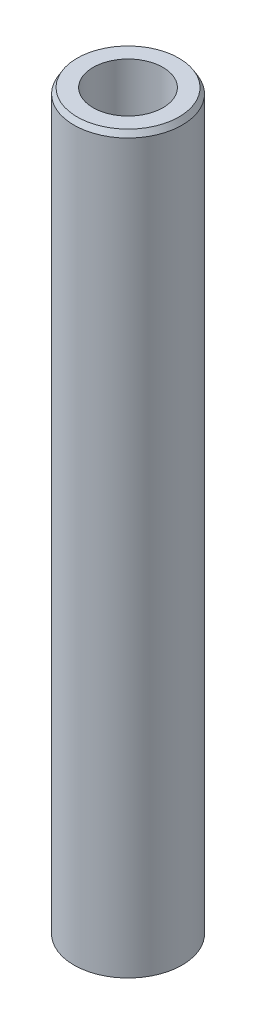
ISO-10303-21;
HEADER;
FILE_DESCRIPTION(('STEP AP214'),'2;1');
FILE_NAME('part.step','',(''),(''),'','','');
FILE_SCHEMA(('AUTOMOTIVE_DESIGN { 1 0 10303 214 1 1 1 1 }'));
ENDSEC;
DATA;
#1=APPLICATION_CONTEXT('core data for automotive mechanical design processes');
#2=APPLICATION_PROTOCOL_DEFINITION('international standard','automotive_design',2000,#1);
#3=PRODUCT_CONTEXT('',#1,'mechanical');
#4=PRODUCT('Part','Part','',(#3));
#5=PRODUCT_RELATED_PRODUCT_CATEGORY('part','',(#4));
#6=PRODUCT_DEFINITION_FORMATION('','',#4);
#7=PRODUCT_DEFINITION_CONTEXT('part definition',#1,'design');
#8=PRODUCT_DEFINITION('design','',#6,#7);
#9=PRODUCT_DEFINITION_SHAPE('','',#8);
#10=(LENGTH_UNIT() NAMED_UNIT(*) SI_UNIT(.MILLI.,.METRE.));
#11=(NAMED_UNIT(*) PLANE_ANGLE_UNIT() SI_UNIT($,.RADIAN.));
#12=(NAMED_UNIT(*) SI_UNIT($,.STERADIAN.) SOLID_ANGLE_UNIT());
#13=UNCERTAINTY_MEASURE_WITH_UNIT(LENGTH_MEASURE(1.E-05),#10,'distance_accuracy_value','');
#14=(GEOMETRIC_REPRESENTATION_CONTEXT(3) GLOBAL_UNCERTAINTY_ASSIGNED_CONTEXT((#13)) GLOBAL_UNIT_ASSIGNED_CONTEXT((#10,
#11,#12)) REPRESENTATION_CONTEXT('',''));
#15=CARTESIAN_POINT('',(0.,0.,0.));
#16=DIRECTION('',(0.,0.,1.));
#17=DIRECTION('',(1.,0.,0.));
#18=AXIS2_PLACEMENT_3D('',#15,#16,#17);
#19=CARTESIAN_POINT('',(0.,102.049210946961,0.));
#20=DIRECTION('',(0.,-1.,0.));
#21=DIRECTION('',(0.,0.,-1.));
#22=AXIS2_PLACEMENT_3D('',#19,#20,#21);
#23=CYLINDRICAL_SURFACE('',#22,7.5);
#24=CARTESIAN_POINT('',(0.,101.286577049852,0.));
#25=DIRECTION('',(0.,1.,0.));
#26=DIRECTION('',(0.,0.,1.));
#27=AXIS2_PLACEMENT_3D('',#24,#25,#26);
#28=CIRCLE('',#27,7.5);
#29=CARTESIAN_POINT('',(0.,101.286577049852,-7.5));
#30=VERTEX_POINT('',#29);
#31=EDGE_CURVE('E50',#30,#30,#28,.F.);
#32=ORIENTED_EDGE('',*,*,#31,.T.);
#33=EDGE_LOOP('',(#32));
#34=FACE_BOUND('',#33,.T.);
#35=CARTESIAN_POINT('',(0.,0.440306885789027,0.));
#36=DIRECTION('',(0.,1.,0.));
#37=DIRECTION('',(0.,0.,1.));
#38=AXIS2_PLACEMENT_3D('',#35,#36,#37);
#39=CIRCLE('',#38,7.5);
#40=CARTESIAN_POINT('',(0.,0.440306885789027,7.5));
#41=VERTEX_POINT('',#40);
#42=EDGE_CURVE('E51',#41,#41,#39,.T.);
#43=ORIENTED_EDGE('',*,*,#42,.T.);
#44=EDGE_LOOP('',(#43));
#45=FACE_BOUND('',#44,.T.);
#46=ADVANCED_FACE('F39',(#34,#45),#23,.T.);
#47=CARTESIAN_POINT('',(0.,102.049210946961,0.));
#48=DIRECTION('',(0.,1.,0.));
#49=DIRECTION('',(0.,0.,1.));
#50=AXIS2_PLACEMENT_3D('',#47,#48,#49);
#51=PLANE('',#50);
#52=CARTESIAN_POINT('',(0.,102.049210946961,0.));
#53=DIRECTION('',(0.,1.,0.));
#54=DIRECTION('',(0.,0.,1.));
#55=AXIS2_PLACEMENT_3D('',#52,#53,#54);
#56=CIRCLE('',#55,7.05969311421097);
#57=CARTESIAN_POINT('',(0.,102.049210946961,-7.05969311421097));
#58=VERTEX_POINT('',#57);
#59=EDGE_CURVE('E54',#58,#58,#56,.T.);
#60=ORIENTED_EDGE('',*,*,#59,.T.);
#61=EDGE_LOOP('',(#60));
#62=FACE_BOUND('',#61,.T.);
#63=CARTESIAN_POINT('',(0.,102.049210946961,0.));
#64=DIRECTION('',(0.,1.,0.));
#65=DIRECTION('',(0.,0.,1.));
#66=AXIS2_PLACEMENT_3D('',#63,#64,#65);
#67=CIRCLE('',#66,4.84571546352787);
#68=CARTESIAN_POINT('',(0.,102.049210946961,4.84571546352787));
#69=VERTEX_POINT('',#68);
#70=EDGE_CURVE('E58',#69,#69,#67,.T.);
#71=ORIENTED_EDGE('',*,*,#70,.F.);
#72=EDGE_LOOP('',(#71));
#73=FACE_BOUND('',#72,.T.);
#74=ADVANCED_FACE('F69',(#62,#73),#51,.T.);
#75=CARTESIAN_POINT('',(0.,0.,0.));
#76=DIRECTION('',(0.,1.,0.));
#77=DIRECTION('',(0.,0.,1.));
#78=AXIS2_PLACEMENT_3D('',#75,#76,#77);
#79=PLANE('',#78);
#80=CARTESIAN_POINT('',(0.,0.,0.));
#81=DIRECTION('',(0.,1.,0.));
#82=DIRECTION('',(0.,0.,1.));
#83=AXIS2_PLACEMENT_3D('',#80,#81,#82);
#84=CIRCLE('',#83,6.73736610289097);
#85=CARTESIAN_POINT('',(0.,0.,6.73736610289097));
#86=VERTEX_POINT('',#85);
#87=EDGE_CURVE('E10',#86,#86,#84,.F.);
#88=ORIENTED_EDGE('',*,*,#87,.T.);
#89=EDGE_LOOP('',(#88));
#90=FACE_BOUND('',#89,.T.);
#91=CARTESIAN_POINT('',(0.,0.,0.));
#92=DIRECTION('',(0.,1.,0.));
#93=DIRECTION('',(0.,0.,1.));
#94=AXIS2_PLACEMENT_3D('',#91,#92,#93);
#95=CIRCLE('',#94,4.84571546352787);
#96=CARTESIAN_POINT('',(0.,0.,4.84571546352787));
#97=VERTEX_POINT('',#96);
#98=EDGE_CURVE('E63',#97,#97,#95,.T.);
#99=ORIENTED_EDGE('',*,*,#98,.T.);
#100=EDGE_LOOP('',(#99));
#101=FACE_BOUND('',#100,.T.);
#102=ADVANCED_FACE('F75',(#90,#101),#79,.F.);
#103=CARTESIAN_POINT('',(0.,102.049210946961,0.));
#104=DIRECTION('',(0.,-1.,0.));
#105=DIRECTION('',(0.,0.,-1.));
#106=AXIS2_PLACEMENT_3D('',#103,#104,#105);
#107=CYLINDRICAL_SURFACE('',#106,4.84571546352787);
#108=ORIENTED_EDGE('',*,*,#70,.T.);
#109=EDGE_LOOP('',(#108));
#110=FACE_BOUND('',#109,.T.);
#111=ORIENTED_EDGE('',*,*,#98,.F.);
#112=EDGE_LOOP('',(#111));
#113=FACE_BOUND('',#112,.T.);
#114=ADVANCED_FACE('F70',(#110,#113),#107,.F.);
#115=CARTESIAN_POINT('',(0.,102.049210946961,0.));
#116=DIRECTION('',(0.,-1.,0.));
#117=DIRECTION('',(0.,0.,-1.));
#118=AXIS2_PLACEMENT_3D('',#115,#116,#117);
#119=CONICAL_SURFACE('',#118,7.05969311421097,0.523598775598296);
#120=CARTESIAN_POINT('',(0.,101.286577049852,-7.5));
#121=CARTESIAN_POINT('',(0.,101.294521152947,-7.4954134699397));
#122=CARTESIAN_POINT('',(0.,101.302465256042,-7.4908269398794));
#123=CARTESIAN_POINT('',(0.,101.318353462232,-7.4816538797588));
#124=CARTESIAN_POINT('',(0.,101.326297565327,-7.47706734969849));
#125=CARTESIAN_POINT('',(0.,101.342185771516,-7.46789428957789));
#126=CARTESIAN_POINT('',(0.,101.350129874611,-7.46330775951758));
#127=CARTESIAN_POINT('',(0.,101.366018080801,-7.45413469939698));
#128=CARTESIAN_POINT('',(0.,101.373962183896,-7.44954816933668));
#129=CARTESIAN_POINT('',(0.,101.389850390086,-7.44037510921607));
#130=CARTESIAN_POINT('',(0.,101.397794493181,-7.43578857915577));
#131=CARTESIAN_POINT('',(0.,101.41368269937,-7.42661551903516));
#132=CARTESIAN_POINT('',(0.,101.421626802465,-7.42202898897486));
#133=CARTESIAN_POINT('',(0.,101.437515008655,-7.41285592885426));
#134=CARTESIAN_POINT('',(0.,101.44545911175,-7.40826939879396));
#135=CARTESIAN_POINT('',(0.,101.46134731794,-7.39909633867335));
#136=CARTESIAN_POINT('',(0.,101.469291421035,-7.39450980861305));
#137=CARTESIAN_POINT('',(0.,101.485179627224,-7.38533674849244));
#138=CARTESIAN_POINT('',(0.,101.493123730319,-7.38075021843214));
#139=CARTESIAN_POINT('',(0.,101.509011936509,-7.37157715831154));
#140=CARTESIAN_POINT('',(0.,101.516956039604,-7.36699062825123));
#141=CARTESIAN_POINT('',(0.,101.532844245794,-7.35781756813063));
#142=CARTESIAN_POINT('',(0.,101.540788348889,-7.35323103807033));
#143=CARTESIAN_POINT('',(0.,101.556676555078,-7.34405797794972));
#144=CARTESIAN_POINT('',(0.,101.564620658173,-7.33947144788942));
#145=CARTESIAN_POINT('',(0.,101.580508864363,-7.33029838776881));
#146=CARTESIAN_POINT('',(0.,101.588452967458,-7.32571185770851));
#147=CARTESIAN_POINT('',(0.,101.604341173648,-7.31653879758791));
#148=CARTESIAN_POINT('',(0.,101.612285276742,-7.3119522675276));
#149=CARTESIAN_POINT('',(0.,101.628173482932,-7.302779207407));
#150=CARTESIAN_POINT('',(0.,101.636117586027,-7.2981926773467));
#151=CARTESIAN_POINT('',(0.,101.652005792217,-7.28901961722609));
#152=CARTESIAN_POINT('',(0.,101.659949895312,-7.28443308716579));
#153=CARTESIAN_POINT('',(0.,101.675838101502,-7.27526002704518));
#154=CARTESIAN_POINT('',(0.,101.683782204596,-7.27067349698488));
#155=CARTESIAN_POINT('',(0.,101.699670410786,-7.26150043686428));
#156=CARTESIAN_POINT('',(0.,101.707614513881,-7.25691390680397));
#157=CARTESIAN_POINT('',(0.,101.723502720071,-7.24774084668337));
#158=CARTESIAN_POINT('',(0.,101.731446823166,-7.24315431662307));
#159=CARTESIAN_POINT('',(0.,101.747335029356,-7.23398125650246));
#160=CARTESIAN_POINT('',(0.,101.75527913245,-7.22939472644216));
#161=CARTESIAN_POINT('',(0.,101.77116733864,-7.22022166632155));
#162=CARTESIAN_POINT('',(0.,101.779111441735,-7.21563513626125));
#163=CARTESIAN_POINT('',(0.,101.794999647925,-7.20646207614065));
#164=CARTESIAN_POINT('',(0.,101.80294375102,-7.20187554608035));
#165=CARTESIAN_POINT('',(0.,101.81883195721,-7.19270248595974));
#166=CARTESIAN_POINT('',(0.,101.826776060304,-7.18811595589944));
#167=CARTESIAN_POINT('',(0.,101.842664266494,-7.17894289577883));
#168=CARTESIAN_POINT('',(0.,101.850608369589,-7.17435636571853));
#169=CARTESIAN_POINT('',(0.,101.866496575779,-7.16518330559793));
#170=CARTESIAN_POINT('',(0.,101.874440678874,-7.16059677553762));
#171=CARTESIAN_POINT('',(0.,101.890328885064,-7.15142371541702));
#172=CARTESIAN_POINT('',(0.,101.898272988158,-7.14683718535671));
#173=CARTESIAN_POINT('',(0.,101.914161194348,-7.13766412523611));
#174=CARTESIAN_POINT('',(0.,101.922105297443,-7.13307759517581));
#175=CARTESIAN_POINT('',(0.,101.937993503633,-7.12390453505521));
#176=CARTESIAN_POINT('',(0.,101.945937606728,-7.1193180049949));
#177=CARTESIAN_POINT('',(0.,101.961825812917,-7.1101449448743));
#178=CARTESIAN_POINT('',(0.,101.969769916012,-7.10555841481399));
#179=CARTESIAN_POINT('',(0.,101.985658122202,-7.09638535469339));
#180=CARTESIAN_POINT('',(0.,101.993602225297,-7.09179882463309));
#181=CARTESIAN_POINT('',(0.,102.009490431487,-7.08262576451248));
#182=CARTESIAN_POINT('',(0.,102.017434534582,-7.07803923445218));
#183=CARTESIAN_POINT('',(0.,102.033322740771,-7.06886617433157));
#184=CARTESIAN_POINT('',(0.,102.041266843866,-7.06427964427127));
#185=CARTESIAN_POINT('',(0.,102.049210946961,-7.05969311421097));
#186=B_SPLINE_CURVE_WITH_KNOTS('',3,(#120,#121,#122,#123,#124,#125,#126,#127,#128,#129,#130,
#131,#132,#133,#134,#135,#136,#137,#138,#139,#140,#141,#142,#143,#144,#145,#146,#147,#148,#149,
#150,#151,#152,#153,#154,#155,#156,#157,#158,#159,#160,#161,#162,#163,#164,#165,#166,#167,#168,
#169,#170,#171,#172,#173,#174,#175,#176,#177,#178,#179,#180,#181,#182,#183,#184,#185),
.UNSPECIFIED.,.F.,.F.,(4,2,2,2,2,2,2,2,2,2,2,2,2,2,2,2,2,2,2,2,2,2,2,2,2,2,2,2,2,2,2,2,4),(0.,
0.0275191803618244,0.0550383607236372,0.0825575410854496,0.110076721447262,0.137595901809075,
0.165115082170899,0.192634262532712,0.220153442894524,0.247672623256336,0.275191803618149,
0.302710983979974,0.330230164341786,0.357749344703599,0.385268525065411,0.412787705427224,
0.440306885789036,0.467826066150861,0.495345246512673,0.522864426874486,0.550383607236298,
0.577902787598111,0.605421967959935,0.632941148321748,0.66046032868356,0.687979509045373,
0.715498689407185,0.743017869769009,0.770537050130822,0.798056230492635,0.825575410854447,
0.853094591216259,0.880613771578084),.UNSPECIFIED.);
#187=EDGE_CURVE('BSEAM81',#30,#58,#186,.T.);
#188=ORIENTED_EDGE('',*,*,#31,.F.);
#189=ORIENTED_EDGE('',*,*,#59,.F.);
#190=ORIENTED_EDGE('',*,*,#187,.T.);
#191=ORIENTED_EDGE('',*,*,#187,.F.);
#192=EDGE_LOOP('',(#188,#190,#189,#191));
#193=FACE_BOUND('',#192,.T.);
#194=ADVANCED_FACE('F81',(#193),#119,.T.);
#195=CARTESIAN_POINT('',(0.,0.440306885789027,0.));
#196=DIRECTION('',(0.,1.,0.));
#197=DIRECTION('',(0.,0.,1.));
#198=AXIS2_PLACEMENT_3D('',#195,#196,#197);
#199=CONICAL_SURFACE('',#198,7.5,1.0471975511966);
#200=ORIENTED_EDGE('',*,*,#87,.F.);
#201=EDGE_LOOP('',(#200));
#202=FACE_BOUND('',#201,.T.);
#203=ORIENTED_EDGE('',*,*,#42,.F.);
#204=EDGE_LOOP('',(#203));
#205=FACE_BOUND('',#204,.T.);
#206=ADVANCED_FACE('F45',(#202,#205),#199,.T.);
#207=CLOSED_SHELL('',(#46,#74,#102,#114,#194,#206));
#208=MANIFOLD_SOLID_BREP('B2',#207);
#209=ADVANCED_BREP_SHAPE_REPRESENTATION('',(#18,#208),#14);
#210=SHAPE_DEFINITION_REPRESENTATION(#9,#209);
ENDSEC;
END-ISO-10303-21;
